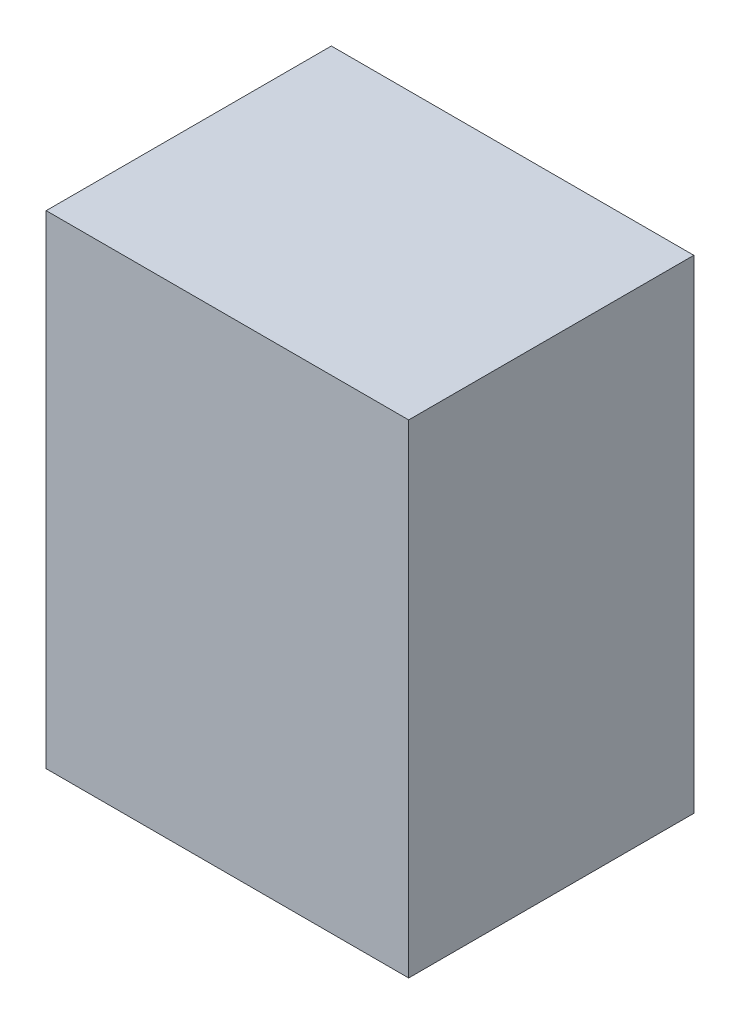
ISO-10303-21;
HEADER;
FILE_DESCRIPTION(('STEP AP214'),'2;1');
FILE_NAME('part.step','',(''),(''),'','','');
FILE_SCHEMA(('AUTOMOTIVE_DESIGN { 1 0 10303 214 1 1 1 1 }'));
ENDSEC;
DATA;
#1=APPLICATION_CONTEXT('core data for automotive mechanical design processes');
#2=APPLICATION_PROTOCOL_DEFINITION('international standard','automotive_design',2000,#1);
#3=PRODUCT_CONTEXT('',#1,'mechanical');
#4=PRODUCT('Part','Part','',(#3));
#5=PRODUCT_RELATED_PRODUCT_CATEGORY('part','',(#4));
#6=PRODUCT_DEFINITION_FORMATION('','',#4);
#7=PRODUCT_DEFINITION_CONTEXT('part definition',#1,'design');
#8=PRODUCT_DEFINITION('design','',#6,#7);
#9=PRODUCT_DEFINITION_SHAPE('','',#8);
#10=(LENGTH_UNIT() NAMED_UNIT(*) SI_UNIT(.MILLI.,.METRE.));
#11=(NAMED_UNIT(*) PLANE_ANGLE_UNIT() SI_UNIT($,.RADIAN.));
#12=(NAMED_UNIT(*) SI_UNIT($,.STERADIAN.) SOLID_ANGLE_UNIT());
#13=UNCERTAINTY_MEASURE_WITH_UNIT(LENGTH_MEASURE(1.E-05),#10,'distance_accuracy_value','');
#14=(GEOMETRIC_REPRESENTATION_CONTEXT(3) GLOBAL_UNCERTAINTY_ASSIGNED_CONTEXT((#13)) GLOBAL_UNIT_ASSIGNED_CONTEXT((#10,
#11,#12)) REPRESENTATION_CONTEXT('',''));
#15=CARTESIAN_POINT('',(0.,0.,0.));
#16=DIRECTION('',(0.,0.,1.));
#17=DIRECTION('',(1.,0.,0.));
#18=AXIS2_PLACEMENT_3D('',#15,#16,#17);
#19=CARTESIAN_POINT('',(-0.74997564,1.00000308,1.18000018));
#20=DIRECTION('',(0.,0.,-1.));
#21=DIRECTION('',(0.,-1.,0.));
#22=AXIS2_PLACEMENT_3D('',#19,#20,#21);
#23=PLANE('',#22);
#24=DIRECTION('',(-1.5239972410078E-05,-0.999999999883872,0.));
#25=VECTOR('',#24,1.);
#26=CARTESIAN_POINT('',(-0.74997564,1.00000308,1.18000018));
#27=LINE('',#26,#25);
#28=CARTESIAN_POINT('',(-0.74997564,1.00000308,1.18000018));
#29=VERTEX_POINT('',#28);
#30=CARTESIAN_POINT('',(-0.75000612,-1.00000054,1.18000018));
#31=VERTEX_POINT('',#30);
#32=EDGE_CURVE('E82',#29,#31,#27,.T.);
#33=ORIENTED_EDGE('',*,*,#32,.T.);
#34=DIRECTION('',(0.999999999998566,-1.69331953278827E-06,0.));
#35=VECTOR('',#34,1.);
#36=CARTESIAN_POINT('',(-0.75000612,-1.00000054,1.18000018));
#37=LINE('',#36,#35);
#38=CARTESIAN_POINT('',(0.75000612,-1.00000308,1.18000018));
#39=VERTEX_POINT('',#38);
#40=EDGE_CURVE('E80',#31,#39,#37,.T.);
#41=ORIENTED_EDGE('',*,*,#40,.T.);
#42=DIRECTION('',(0.,1.,0.));
#43=VECTOR('',#42,1.);
#44=CARTESIAN_POINT('',(0.75000612,-1.00000308,1.18000018));
#45=LINE('',#44,#43);
#46=CARTESIAN_POINT('',(0.75000612,0.99997768,1.18000018));
#47=VERTEX_POINT('',#46);
#48=EDGE_CURVE('E68',#39,#47,#45,.T.);
#49=ORIENTED_EDGE('',*,*,#48,.T.);
#50=DIRECTION('',(-0.999999999856628,1.69335392227137E-05,0.));
#51=VECTOR('',#50,1.);
#52=CARTESIAN_POINT('',(0.75000612,0.99997768,1.18000018));
#53=LINE('',#52,#51);
#54=EDGE_CURVE('E11',#47,#29,#53,.T.);
#55=ORIENTED_EDGE('',*,*,#54,.T.);
#56=EDGE_LOOP('',(#33,#41,#49,#55));
#57=FACE_BOUND('',#56,.T.);
#58=ADVANCED_FACE('F17',(#57),#23,.F.);
#59=CARTESIAN_POINT('',(-0.74997564,1.00000308,0.));
#60=DIRECTION('',(0.,0.,-1.));
#61=DIRECTION('',(0.,-1.,0.));
#62=AXIS2_PLACEMENT_3D('',#59,#60,#61);
#63=PLANE('',#62);
#64=DIRECTION('',(-1.5239972410078E-05,-0.999999999883872,0.));
#65=VECTOR('',#64,1.);
#66=CARTESIAN_POINT('',(-0.74997564,1.00000308,0.));
#67=LINE('',#66,#65);
#68=CARTESIAN_POINT('',(-0.74997564,1.00000308,0.));
#69=VERTEX_POINT('',#68);
#70=CARTESIAN_POINT('',(-0.75000612,-1.00000054,0.));
#71=VERTEX_POINT('',#70);
#72=EDGE_CURVE('E98',#69,#71,#67,.T.);
#73=ORIENTED_EDGE('',*,*,#72,.F.);
#74=DIRECTION('',(-0.999999999856628,1.69335392227137E-05,0.));
#75=VECTOR('',#74,1.);
#76=CARTESIAN_POINT('',(0.75000612,0.99997768,0.));
#77=LINE('',#76,#75);
#78=CARTESIAN_POINT('',(0.75000612,0.99997768,0.));
#79=VERTEX_POINT('',#78);
#80=EDGE_CURVE('E28',#79,#69,#77,.T.);
#81=ORIENTED_EDGE('',*,*,#80,.F.);
#82=DIRECTION('',(0.,1.,0.));
#83=VECTOR('',#82,1.);
#84=CARTESIAN_POINT('',(0.75000612,-1.00000308,0.));
#85=LINE('',#84,#83);
#86=CARTESIAN_POINT('',(0.75000612,-1.00000308,0.));
#87=VERTEX_POINT('',#86);
#88=EDGE_CURVE('E21',#87,#79,#85,.T.);
#89=ORIENTED_EDGE('',*,*,#88,.F.);
#90=DIRECTION('',(0.999999999998566,-1.69331953278827E-06,0.));
#91=VECTOR('',#90,1.);
#92=CARTESIAN_POINT('',(-0.75000612,-1.00000054,0.));
#93=LINE('',#92,#91);
#94=EDGE_CURVE('E89',#71,#87,#93,.T.);
#95=ORIENTED_EDGE('',*,*,#94,.F.);
#96=EDGE_LOOP('',(#73,#81,#89,#95));
#97=FACE_BOUND('',#96,.T.);
#98=ADVANCED_FACE('F19',(#97),#63,.T.);
#99=CARTESIAN_POINT('',(0.75000612,0.99997768,0.));
#100=DIRECTION('',(-1.69335392227137E-05,-0.999999999856628,0.));
#101=DIRECTION('',(-0.999999999856628,1.69335392227137E-05,0.));
#102=AXIS2_PLACEMENT_3D('',#99,#100,#101);
#103=PLANE('',#102);
#104=DIRECTION('',(0.,0.,1.));
#105=VECTOR('',#104,1.);
#106=CARTESIAN_POINT('',(0.75000612,0.99997768,0.));
#107=LINE('',#106,#105);
#108=EDGE_CURVE('E75',#79,#47,#107,.T.);
#109=ORIENTED_EDGE('',*,*,#108,.F.);
#110=ORIENTED_EDGE('',*,*,#80,.T.);
#111=DIRECTION('',(0.,0.,1.));
#112=VECTOR('',#111,1.);
#113=CARTESIAN_POINT('',(-0.74997564,1.00000308,0.));
#114=LINE('',#113,#112);
#115=EDGE_CURVE('E110',#69,#29,#114,.T.);
#116=ORIENTED_EDGE('',*,*,#115,.T.);
#117=ORIENTED_EDGE('',*,*,#54,.F.);
#118=EDGE_LOOP('',(#109,#110,#116,#117));
#119=FACE_BOUND('',#118,.T.);
#120=ADVANCED_FACE('F119',(#119),#103,.F.);
#121=CARTESIAN_POINT('',(0.75000612,-1.00000308,0.));
#122=DIRECTION('',(-1.,0.,0.));
#123=DIRECTION('',(0.,0.,1.));
#124=AXIS2_PLACEMENT_3D('',#121,#122,#123);
#125=PLANE('',#124);
#126=DIRECTION('',(0.,0.,1.));
#127=VECTOR('',#126,1.);
#128=CARTESIAN_POINT('',(0.75000612,-1.00000308,0.));
#129=LINE('',#128,#127);
#130=EDGE_CURVE('E73',#87,#39,#129,.T.);
#131=ORIENTED_EDGE('',*,*,#130,.F.);
#132=ORIENTED_EDGE('',*,*,#88,.T.);
#133=ORIENTED_EDGE('',*,*,#108,.T.);
#134=ORIENTED_EDGE('',*,*,#48,.F.);
#135=EDGE_LOOP('',(#131,#132,#133,#134));
#136=FACE_BOUND('',#135,.T.);
#137=ADVANCED_FACE('F70',(#136),#125,.F.);
#138=CARTESIAN_POINT('',(-0.75000612,-1.00000054,0.));
#139=DIRECTION('',(1.69331953278827E-06,0.999999999998566,0.));
#140=DIRECTION('',(0.,0.,-1.));
#141=AXIS2_PLACEMENT_3D('',#138,#139,#140);
#142=PLANE('',#141);
#143=DIRECTION('',(0.,0.,1.));
#144=VECTOR('',#143,1.);
#145=CARTESIAN_POINT('',(-0.75000612,-1.00000054,0.));
#146=LINE('',#145,#144);
#147=EDGE_CURVE('E100',#71,#31,#146,.T.);
#148=ORIENTED_EDGE('',*,*,#147,.F.);
#149=ORIENTED_EDGE('',*,*,#94,.T.);
#150=ORIENTED_EDGE('',*,*,#130,.T.);
#151=ORIENTED_EDGE('',*,*,#40,.F.);
#152=EDGE_LOOP('',(#148,#149,#150,#151));
#153=FACE_BOUND('',#152,.T.);
#154=ADVANCED_FACE('F88',(#153),#142,.F.);
#155=CARTESIAN_POINT('',(-0.74997564,1.00000308,0.));
#156=DIRECTION('',(0.999999999883872,-1.5239972410078E-05,0.));
#157=DIRECTION('',(0.,0.,-1.));
#158=AXIS2_PLACEMENT_3D('',#155,#156,#157);
#159=PLANE('',#158);
#160=ORIENTED_EDGE('',*,*,#115,.F.);
#161=ORIENTED_EDGE('',*,*,#72,.T.);
#162=ORIENTED_EDGE('',*,*,#147,.T.);
#163=ORIENTED_EDGE('',*,*,#32,.F.);
#164=EDGE_LOOP('',(#160,#161,#162,#163));
#165=FACE_BOUND('',#164,.T.);
#166=ADVANCED_FACE('F122',(#165),#159,.F.);
#167=CLOSED_SHELL('',(#58,#98,#120,#137,#154,#166));
#168=MANIFOLD_SOLID_BREP('B1',#167);
#169=ADVANCED_BREP_SHAPE_REPRESENTATION('',(#18,#168),#14);
#170=SHAPE_DEFINITION_REPRESENTATION(#9,#169);
ENDSEC;
END-ISO-10303-21;
